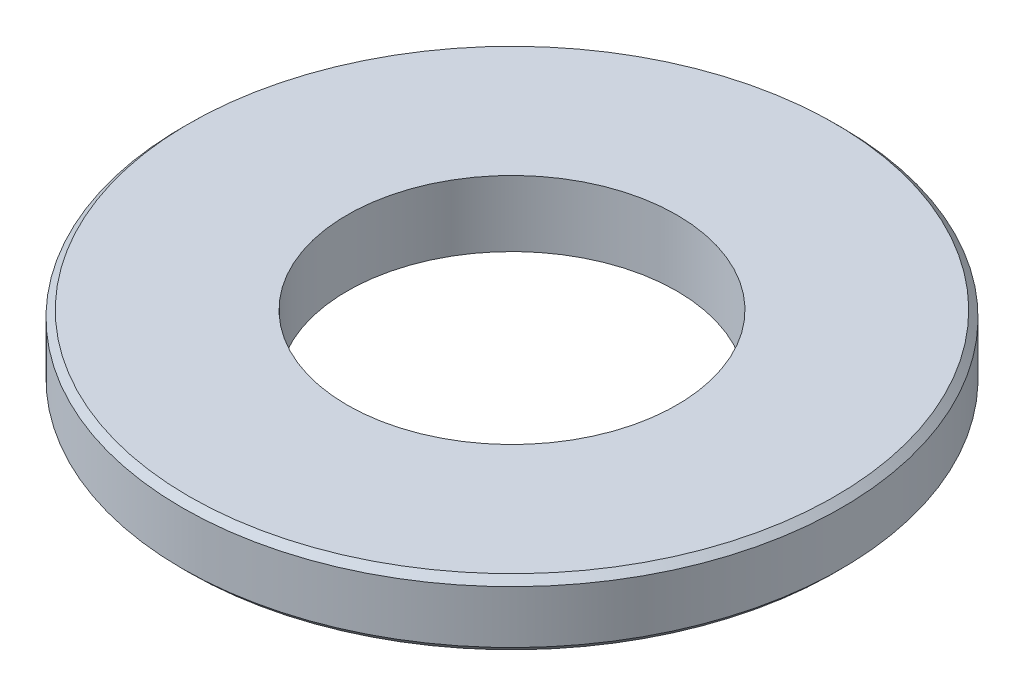
ISO-10303-21;
HEADER;
FILE_DESCRIPTION(('STEP AP214'),'2;1');
FILE_NAME('part.step','',(''),(''),'','','');
FILE_SCHEMA(('AUTOMOTIVE_DESIGN { 1 0 10303 214 1 1 1 1 }'));
ENDSEC;
DATA;
#1=APPLICATION_CONTEXT('core data for automotive mechanical design processes');
#2=APPLICATION_PROTOCOL_DEFINITION('international standard','automotive_design',2000,#1);
#3=PRODUCT_CONTEXT('',#1,'mechanical');
#4=PRODUCT('Part','Part','',(#3));
#5=PRODUCT_RELATED_PRODUCT_CATEGORY('part','',(#4));
#6=PRODUCT_DEFINITION_FORMATION('','',#4);
#7=PRODUCT_DEFINITION_CONTEXT('part definition',#1,'design');
#8=PRODUCT_DEFINITION('design','',#6,#7);
#9=PRODUCT_DEFINITION_SHAPE('','',#8);
#10=(LENGTH_UNIT() NAMED_UNIT(*) SI_UNIT(.MILLI.,.METRE.));
#11=(NAMED_UNIT(*) PLANE_ANGLE_UNIT() SI_UNIT($,.RADIAN.));
#12=(NAMED_UNIT(*) SI_UNIT($,.STERADIAN.) SOLID_ANGLE_UNIT());
#13=UNCERTAINTY_MEASURE_WITH_UNIT(LENGTH_MEASURE(1.E-05),#10,'distance_accuracy_value','');
#14=(GEOMETRIC_REPRESENTATION_CONTEXT(3) GLOBAL_UNCERTAINTY_ASSIGNED_CONTEXT((#13)) GLOBAL_UNIT_ASSIGNED_CONTEXT((#10,
#11,#12)) REPRESENTATION_CONTEXT('',''));
#15=CARTESIAN_POINT('',(0.,0.,0.));
#16=DIRECTION('',(0.,0.,1.));
#17=DIRECTION('',(1.,0.,0.));
#18=AXIS2_PLACEMENT_3D('',#15,#16,#17);
#19=CARTESIAN_POINT('',(0.,2.54,0.));
#20=DIRECTION('',(0.,1.,0.));
#21=DIRECTION('',(0.,0.,1.));
#22=AXIS2_PLACEMENT_3D('',#19,#20,#21);
#23=PLANE('',#22);
#24=CARTESIAN_POINT('',(0.,2.54,0.));
#25=DIRECTION('',(0.,1.,0.));
#26=DIRECTION('',(0.,0.,1.));
#27=AXIS2_PLACEMENT_3D('',#24,#25,#26);
#28=CIRCLE('',#27,12.446);
#29=CARTESIAN_POINT('',(0.,2.54,12.446));
#30=VERTEX_POINT('',#29);
#31=EDGE_CURVE('E10',#30,#30,#28,.T.);
#32=ORIENTED_EDGE('',*,*,#31,.T.);
#33=EDGE_LOOP('',(#32));
#34=FACE_BOUND('',#33,.T.);
#35=CARTESIAN_POINT('',(0.,2.54,0.));
#36=DIRECTION('',(0.,1.,0.));
#37=DIRECTION('',(0.,0.,1.));
#38=AXIS2_PLACEMENT_3D('',#35,#36,#37);
#39=CIRCLE('',#38,6.35);
#40=CARTESIAN_POINT('',(0.,2.54,6.35));
#41=VERTEX_POINT('',#40);
#42=EDGE_CURVE('E61',#41,#41,#39,.T.);
#43=ORIENTED_EDGE('',*,*,#42,.F.);
#44=EDGE_LOOP('',(#43));
#45=FACE_BOUND('',#44,.T.);
#46=ADVANCED_FACE('F35',(#34,#45),#23,.T.);
#47=CARTESIAN_POINT('',(0.,0.,0.));
#48=DIRECTION('',(0.,1.,0.));
#49=DIRECTION('',(0.,0.,1.));
#50=AXIS2_PLACEMENT_3D('',#47,#48,#49);
#51=PLANE('',#50);
#52=CARTESIAN_POINT('',(0.,0.,0.));
#53=DIRECTION('',(0.,1.,0.));
#54=DIRECTION('',(0.,0.,1.));
#55=AXIS2_PLACEMENT_3D('',#52,#53,#54);
#56=CIRCLE('',#55,12.446);
#57=CARTESIAN_POINT('',(0.,0.,12.446));
#58=VERTEX_POINT('',#57);
#59=EDGE_CURVE('E43',#58,#58,#56,.F.);
#60=ORIENTED_EDGE('',*,*,#59,.T.);
#61=EDGE_LOOP('',(#60));
#62=FACE_BOUND('',#61,.T.);
#63=CARTESIAN_POINT('',(0.,0.,0.));
#64=DIRECTION('',(0.,1.,0.));
#65=DIRECTION('',(0.,0.,1.));
#66=AXIS2_PLACEMENT_3D('',#63,#64,#65);
#67=CIRCLE('',#66,6.35);
#68=CARTESIAN_POINT('',(0.,0.,6.35));
#69=VERTEX_POINT('',#68);
#70=EDGE_CURVE('E62',#69,#69,#67,.T.);
#71=ORIENTED_EDGE('',*,*,#70,.T.);
#72=EDGE_LOOP('',(#71));
#73=FACE_BOUND('',#72,.T.);
#74=ADVANCED_FACE('F72',(#62,#73),#51,.F.);
#75=CARTESIAN_POINT('',(0.,2.54,0.));
#76=DIRECTION('',(0.,-1.,0.));
#77=DIRECTION('',(0.,0.,-1.));
#78=AXIS2_PLACEMENT_3D('',#75,#76,#77);
#79=CYLINDRICAL_SURFACE('',#78,12.7);
#80=CARTESIAN_POINT('',(0.,0.253999999999999,0.));
#81=DIRECTION('',(0.,1.,0.));
#82=DIRECTION('',(0.,0.,1.));
#83=AXIS2_PLACEMENT_3D('',#80,#81,#82);
#84=CIRCLE('',#83,12.7);
#85=CARTESIAN_POINT('',(0.,0.253999999999999,12.7));
#86=VERTEX_POINT('',#85);
#87=EDGE_CURVE('E50',#86,#86,#84,.T.);
#88=ORIENTED_EDGE('',*,*,#87,.T.);
#89=EDGE_LOOP('',(#88));
#90=FACE_BOUND('',#89,.T.);
#91=CARTESIAN_POINT('',(0.,2.28599999999999,0.));
#92=DIRECTION('',(0.,1.,0.));
#93=DIRECTION('',(0.,0.,1.));
#94=AXIS2_PLACEMENT_3D('',#91,#92,#93);
#95=CIRCLE('',#94,12.7);
#96=CARTESIAN_POINT('',(0.,2.28599999999999,12.7));
#97=VERTEX_POINT('',#96);
#98=EDGE_CURVE('E56',#97,#97,#95,.F.);
#99=ORIENTED_EDGE('',*,*,#98,.T.);
#100=EDGE_LOOP('',(#99));
#101=FACE_BOUND('',#100,.T.);
#102=ADVANCED_FACE('F77',(#90,#101),#79,.T.);
#103=CARTESIAN_POINT('',(0.,2.54,0.));
#104=DIRECTION('',(0.,-1.,0.));
#105=DIRECTION('',(0.,0.,-1.));
#106=AXIS2_PLACEMENT_3D('',#103,#104,#105);
#107=CYLINDRICAL_SURFACE('',#106,6.35);
#108=ORIENTED_EDGE('',*,*,#42,.T.);
#109=EDGE_LOOP('',(#108));
#110=FACE_BOUND('',#109,.T.);
#111=ORIENTED_EDGE('',*,*,#70,.F.);
#112=EDGE_LOOP('',(#111));
#113=FACE_BOUND('',#112,.T.);
#114=ADVANCED_FACE('F68',(#110,#113),#107,.F.);
#115=CARTESIAN_POINT('',(0.,0.253999999999999,0.));
#116=DIRECTION('',(0.,1.,0.));
#117=DIRECTION('',(0.,0.,1.));
#118=AXIS2_PLACEMENT_3D('',#115,#116,#117);
#119=CONICAL_SURFACE('',#118,12.7,0.785398163397448);
#120=ORIENTED_EDGE('',*,*,#59,.F.);
#121=EDGE_LOOP('',(#120));
#122=FACE_BOUND('',#121,.T.);
#123=ORIENTED_EDGE('',*,*,#87,.F.);
#124=EDGE_LOOP('',(#123));
#125=FACE_BOUND('',#124,.T.);
#126=ADVANCED_FACE('F83',(#122,#125),#119,.T.);
#127=CARTESIAN_POINT('',(0.,2.54,0.));
#128=DIRECTION('',(0.,-1.,0.));
#129=DIRECTION('',(0.,0.,-1.));
#130=AXIS2_PLACEMENT_3D('',#127,#128,#129);
#131=CONICAL_SURFACE('',#130,12.446,0.785398163397435);
#132=ORIENTED_EDGE('',*,*,#98,.F.);
#133=EDGE_LOOP('',(#132));
#134=FACE_BOUND('',#133,.T.);
#135=ORIENTED_EDGE('',*,*,#31,.F.);
#136=EDGE_LOOP('',(#135));
#137=FACE_BOUND('',#136,.T.);
#138=ADVANCED_FACE('F37',(#134,#137),#131,.T.);
#139=CLOSED_SHELL('',(#46,#74,#102,#114,#126,#138));
#140=MANIFOLD_SOLID_BREP('B2',#139);
#141=ADVANCED_BREP_SHAPE_REPRESENTATION('',(#18,#140),#14);
#142=SHAPE_DEFINITION_REPRESENTATION(#9,#141);
ENDSEC;
END-ISO-10303-21;
